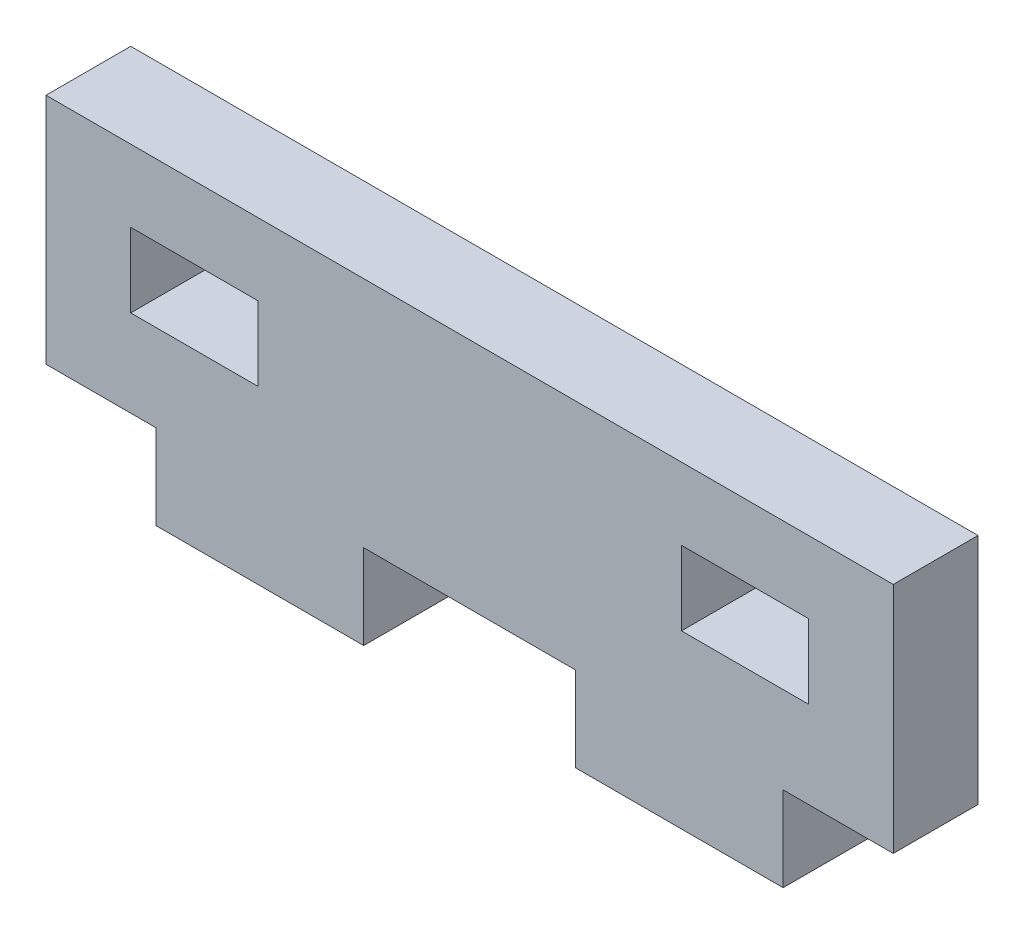
ISO-10303-21;
HEADER;
FILE_DESCRIPTION(('STEP AP214'),'2;1');
FILE_NAME('part.step','',(''),(''),'','','');
FILE_SCHEMA(('AUTOMOTIVE_DESIGN { 1 0 10303 214 1 1 1 1 }'));
ENDSEC;
DATA;
#1=APPLICATION_CONTEXT('core data for automotive mechanical design processes');
#2=APPLICATION_PROTOCOL_DEFINITION('international standard','automotive_design',2000,#1);
#3=PRODUCT_CONTEXT('',#1,'mechanical');
#4=PRODUCT('Part','Part','',(#3));
#5=PRODUCT_RELATED_PRODUCT_CATEGORY('part','',(#4));
#6=PRODUCT_DEFINITION_FORMATION('','',#4);
#7=PRODUCT_DEFINITION_CONTEXT('part definition',#1,'design');
#8=PRODUCT_DEFINITION('design','',#6,#7);
#9=PRODUCT_DEFINITION_SHAPE('','',#8);
#10=(LENGTH_UNIT() NAMED_UNIT(*) SI_UNIT(.MILLI.,.METRE.));
#11=(NAMED_UNIT(*) PLANE_ANGLE_UNIT() SI_UNIT($,.RADIAN.));
#12=(NAMED_UNIT(*) SI_UNIT($,.STERADIAN.) SOLID_ANGLE_UNIT());
#13=UNCERTAINTY_MEASURE_WITH_UNIT(LENGTH_MEASURE(1.E-05),#10,'distance_accuracy_value','');
#14=(GEOMETRIC_REPRESENTATION_CONTEXT(3) GLOBAL_UNCERTAINTY_ASSIGNED_CONTEXT((#13)) GLOBAL_UNIT_ASSIGNED_CONTEXT((#10,
#11,#12)) REPRESENTATION_CONTEXT('',''));
#15=CARTESIAN_POINT('',(0.,0.,0.));
#16=DIRECTION('',(0.,0.,1.));
#17=DIRECTION('',(1.,0.,0.));
#18=AXIS2_PLACEMENT_3D('',#15,#16,#17);
#19=CARTESIAN_POINT('',(35.,0.,4.));
#20=DIRECTION('',(0.,1.,0.));
#21=DIRECTION('',(0.,0.,1.));
#22=AXIS2_PLACEMENT_3D('',#19,#20,#21);
#23=PLANE('',#22);
#24=DIRECTION('',(1.,0.,0.));
#25=VECTOR('',#24,1.);
#26=CARTESIAN_POINT('',(35.,0.,4.));
#27=LINE('',#26,#25);
#28=CARTESIAN_POINT('',(2.7,0.,4.));
#29=VERTEX_POINT('',#28);
#30=CARTESIAN_POINT('',(12.5,0.,4.));
#31=VERTEX_POINT('',#30);
#32=EDGE_CURVE('E293',#29,#31,#27,.T.);
#33=ORIENTED_EDGE('',*,*,#32,.F.);
#34=DIRECTION('',(0.,0.,1.));
#35=VECTOR('',#34,1.);
#36=CARTESIAN_POINT('',(2.7,0.,-0.00100000000000013));
#37=LINE('',#36,#35);
#38=CARTESIAN_POINT('',(2.7,0.,0.));
#39=VERTEX_POINT('',#38);
#40=EDGE_CURVE('E249',#39,#29,#37,.T.);
#41=ORIENTED_EDGE('',*,*,#40,.F.);
#42=DIRECTION('',(1.,0.,0.));
#43=VECTOR('',#42,1.);
#44=CARTESIAN_POINT('',(35.,0.,0.));
#45=LINE('',#44,#43);
#46=CARTESIAN_POINT('',(12.5,0.,0.));
#47=VERTEX_POINT('',#46);
#48=EDGE_CURVE('E308',#39,#47,#45,.T.);
#49=ORIENTED_EDGE('',*,*,#48,.T.);
#50=DIRECTION('',(0.,0.,1.));
#51=VECTOR('',#50,1.);
#52=CARTESIAN_POINT('',(12.5,0.,-0.00100000000000013));
#53=LINE('',#52,#51);
#54=EDGE_CURVE('E273',#47,#31,#53,.T.);
#55=ORIENTED_EDGE('',*,*,#54,.T.);
#56=EDGE_LOOP('',(#33,#41,#49,#55));
#57=FACE_BOUND('',#56,.T.);
#58=ADVANCED_FACE('F35',(#57),#23,.F.);
#59=CARTESIAN_POINT('',(22.5,0.,4.));
#60=VERTEX_POINT('',#59);
#61=CARTESIAN_POINT('',(32.3,0.,4.));
#62=VERTEX_POINT('',#61);
#63=EDGE_CURVE('E290',#60,#62,#27,.T.);
#64=ORIENTED_EDGE('',*,*,#63,.F.);
#65=DIRECTION('',(0.,0.,1.));
#66=VECTOR('',#65,1.);
#67=CARTESIAN_POINT('',(22.5,0.,-0.00100000000000013));
#68=LINE('',#67,#66);
#69=CARTESIAN_POINT('',(22.5,0.,0.));
#70=VERTEX_POINT('',#69);
#71=EDGE_CURVE('E277',#70,#60,#68,.T.);
#72=ORIENTED_EDGE('',*,*,#71,.F.);
#73=CARTESIAN_POINT('',(32.3,0.,0.));
#74=VERTEX_POINT('',#73);
#75=EDGE_CURVE('E253',#70,#74,#45,.T.);
#76=ORIENTED_EDGE('',*,*,#75,.T.);
#77=DIRECTION('',(0.,0.,1.));
#78=VECTOR('',#77,1.);
#79=CARTESIAN_POINT('',(32.3,0.,-0.00100000000000013));
#80=LINE('',#79,#78);
#81=EDGE_CURVE('E285',#74,#62,#80,.T.);
#82=ORIENTED_EDGE('',*,*,#81,.T.);
#83=EDGE_LOOP('',(#64,#72,#76,#82));
#84=FACE_BOUND('',#83,.T.);
#85=ADVANCED_FACE('F37',(#84),#23,.F.);
#86=CARTESIAN_POINT('',(37.5,4.,4.));
#87=DIRECTION('',(0.,1.,0.));
#88=DIRECTION('',(0.,0.,1.));
#89=AXIS2_PLACEMENT_3D('',#86,#87,#88);
#90=PLANE('',#89);
#91=DIRECTION('',(1.,0.,0.));
#92=VECTOR('',#91,1.);
#93=CARTESIAN_POINT('',(37.5,4.,0.));
#94=LINE('',#93,#92);
#95=CARTESIAN_POINT('',(32.3,4.00000000000001,0.));
#96=VERTEX_POINT('',#95);
#97=CARTESIAN_POINT('',(37.5,4.,0.));
#98=VERTEX_POINT('',#97);
#99=EDGE_CURVE('E309',#96,#98,#94,.T.);
#100=ORIENTED_EDGE('',*,*,#99,.T.);
#101=DIRECTION('',(0.,0.,-1.));
#102=VECTOR('',#101,1.);
#103=CARTESIAN_POINT('',(37.5,4.,4.));
#104=LINE('',#103,#102);
#105=CARTESIAN_POINT('',(37.5,4.,4.));
#106=VERTEX_POINT('',#105);
#107=EDGE_CURVE('E11',#106,#98,#104,.T.);
#108=ORIENTED_EDGE('',*,*,#107,.F.);
#109=DIRECTION('',(1.,0.,0.));
#110=VECTOR('',#109,1.);
#111=CARTESIAN_POINT('',(37.5,4.,4.));
#112=LINE('',#111,#110);
#113=CARTESIAN_POINT('',(32.3,4.00000000000001,4.));
#114=VERTEX_POINT('',#113);
#115=EDGE_CURVE('E295',#114,#106,#112,.T.);
#116=ORIENTED_EDGE('',*,*,#115,.F.);
#117=DIRECTION('',(0.,0.,1.));
#118=VECTOR('',#117,1.);
#119=CARTESIAN_POINT('',(32.3,4.00000000000001,-0.00100000000000013));
#120=LINE('',#119,#118);
#121=EDGE_CURVE('E259',#96,#114,#120,.T.);
#122=ORIENTED_EDGE('',*,*,#121,.F.);
#123=EDGE_LOOP('',(#100,#108,#116,#122));
#124=FACE_BOUND('',#123,.T.);
#125=ADVANCED_FACE('F352',(#124),#90,.F.);
#126=CARTESIAN_POINT('',(37.5,15.,4.));
#127=DIRECTION('',(-1.,0.,0.));
#128=DIRECTION('',(0.,0.,1.));
#129=AXIS2_PLACEMENT_3D('',#126,#127,#128);
#130=PLANE('',#129);
#131=DIRECTION('',(0.,1.,0.));
#132=VECTOR('',#131,1.);
#133=CARTESIAN_POINT('',(37.5,15.,0.));
#134=LINE('',#133,#132);
#135=CARTESIAN_POINT('',(37.5,15.,0.));
#136=VERTEX_POINT('',#135);
#137=EDGE_CURVE('E311',#98,#136,#134,.T.);
#138=ORIENTED_EDGE('',*,*,#137,.T.);
#139=DIRECTION('',(0.,0.,-1.));
#140=VECTOR('',#139,1.);
#141=CARTESIAN_POINT('',(37.5,15.,4.));
#142=LINE('',#141,#140);
#143=CARTESIAN_POINT('',(37.5,15.,4.));
#144=VERTEX_POINT('',#143);
#145=EDGE_CURVE('E43',#144,#136,#142,.T.);
#146=ORIENTED_EDGE('',*,*,#145,.F.);
#147=DIRECTION('',(0.,1.,0.));
#148=VECTOR('',#147,1.);
#149=CARTESIAN_POINT('',(37.5,15.,4.));
#150=LINE('',#149,#148);
#151=EDGE_CURVE('E297',#106,#144,#150,.T.);
#152=ORIENTED_EDGE('',*,*,#151,.F.);
#153=ORIENTED_EDGE('',*,*,#107,.T.);
#154=EDGE_LOOP('',(#138,#146,#152,#153));
#155=FACE_BOUND('',#154,.T.);
#156=ADVANCED_FACE('F350',(#155),#130,.F.);
#157=CARTESIAN_POINT('',(-2.5,15.,4.));
#158=DIRECTION('',(0.,-1.,0.));
#159=DIRECTION('',(0.,0.,-1.));
#160=AXIS2_PLACEMENT_3D('',#157,#158,#159);
#161=PLANE('',#160);
#162=DIRECTION('',(-1.,0.,0.));
#163=VECTOR('',#162,1.);
#164=CARTESIAN_POINT('',(-2.5,15.,0.));
#165=LINE('',#164,#163);
#166=CARTESIAN_POINT('',(-2.5,15.,0.));
#167=VERTEX_POINT('',#166);
#168=EDGE_CURVE('E313',#136,#167,#165,.T.);
#169=ORIENTED_EDGE('',*,*,#168,.T.);
#170=DIRECTION('',(0.,0.,-1.));
#171=VECTOR('',#170,1.);
#172=CARTESIAN_POINT('',(-2.5,15.,4.));
#173=LINE('',#172,#171);
#174=CARTESIAN_POINT('',(-2.5,15.,4.));
#175=VERTEX_POINT('',#174);
#176=EDGE_CURVE('E320',#175,#167,#173,.T.);
#177=ORIENTED_EDGE('',*,*,#176,.F.);
#178=DIRECTION('',(-1.,0.,0.));
#179=VECTOR('',#178,1.);
#180=CARTESIAN_POINT('',(-2.5,15.,4.));
#181=LINE('',#180,#179);
#182=EDGE_CURVE('E299',#144,#175,#181,.T.);
#183=ORIENTED_EDGE('',*,*,#182,.F.);
#184=ORIENTED_EDGE('',*,*,#145,.T.);
#185=EDGE_LOOP('',(#169,#177,#183,#184));
#186=FACE_BOUND('',#185,.T.);
#187=ADVANCED_FACE('F327',(#186),#161,.F.);
#188=CARTESIAN_POINT('',(-2.5,4.,4.));
#189=DIRECTION('',(1.,0.,0.));
#190=DIRECTION('',(0.,1.,0.));
#191=AXIS2_PLACEMENT_3D('',#188,#189,#190);
#192=PLANE('',#191);
#193=DIRECTION('',(0.,-1.,0.));
#194=VECTOR('',#193,1.);
#195=CARTESIAN_POINT('',(-2.5,4.,0.));
#196=LINE('',#195,#194);
#197=CARTESIAN_POINT('',(-2.5,4.,0.));
#198=VERTEX_POINT('',#197);
#199=EDGE_CURVE('E315',#167,#198,#196,.T.);
#200=ORIENTED_EDGE('',*,*,#199,.T.);
#201=DIRECTION('',(0.,0.,-1.));
#202=VECTOR('',#201,1.);
#203=CARTESIAN_POINT('',(-2.5,4.,4.));
#204=LINE('',#203,#202);
#205=CARTESIAN_POINT('',(-2.5,4.,4.));
#206=VERTEX_POINT('',#205);
#207=EDGE_CURVE('E305',#206,#198,#204,.T.);
#208=ORIENTED_EDGE('',*,*,#207,.F.);
#209=DIRECTION('',(0.,-1.,0.));
#210=VECTOR('',#209,1.);
#211=CARTESIAN_POINT('',(-2.5,4.,4.));
#212=LINE('',#211,#210);
#213=EDGE_CURVE('E301',#175,#206,#212,.T.);
#214=ORIENTED_EDGE('',*,*,#213,.F.);
#215=ORIENTED_EDGE('',*,*,#176,.T.);
#216=EDGE_LOOP('',(#200,#208,#214,#215));
#217=FACE_BOUND('',#216,.T.);
#218=ADVANCED_FACE('F337',(#217),#192,.F.);
#219=CARTESIAN_POINT('',(0.,4.,4.));
#220=DIRECTION('',(0.,1.,0.));
#221=DIRECTION('',(-1.,0.,0.));
#222=AXIS2_PLACEMENT_3D('',#219,#220,#221);
#223=PLANE('',#222);
#224=DIRECTION('',(1.,0.,0.));
#225=VECTOR('',#224,1.);
#226=CARTESIAN_POINT('',(0.,4.,0.));
#227=LINE('',#226,#225);
#228=CARTESIAN_POINT('',(2.7,4.,0.));
#229=VERTEX_POINT('',#228);
#230=EDGE_CURVE('E294',#198,#229,#227,.T.);
#231=ORIENTED_EDGE('',*,*,#230,.T.);
#232=DIRECTION('',(0.,0.,1.));
#233=VECTOR('',#232,1.);
#234=CARTESIAN_POINT('',(2.7,4.,-0.00100000000000013));
#235=LINE('',#234,#233);
#236=CARTESIAN_POINT('',(2.7,4.,4.));
#237=VERTEX_POINT('',#236);
#238=EDGE_CURVE('E250',#229,#237,#235,.T.);
#239=ORIENTED_EDGE('',*,*,#238,.T.);
#240=DIRECTION('',(1.,0.,0.));
#241=VECTOR('',#240,1.);
#242=CARTESIAN_POINT('',(0.,4.,4.));
#243=LINE('',#242,#241);
#244=EDGE_CURVE('E303',#206,#237,#243,.T.);
#245=ORIENTED_EDGE('',*,*,#244,.F.);
#246=ORIENTED_EDGE('',*,*,#207,.T.);
#247=EDGE_LOOP('',(#231,#239,#245,#246));
#248=FACE_BOUND('',#247,.T.);
#249=ADVANCED_FACE('F341',(#248),#223,.F.);
#250=CARTESIAN_POINT('',(0.,0.,4.));
#251=DIRECTION('',(0.,0.,-1.));
#252=DIRECTION('',(-1.,0.,0.));
#253=AXIS2_PLACEMENT_3D('',#250,#251,#252);
#254=PLANE('',#253);
#255=DIRECTION('',(1.,0.,0.));
#256=VECTOR('',#255,1.);
#257=CARTESIAN_POINT('',(1.5,8.1,4.));
#258=LINE('',#257,#256);
#259=CARTESIAN_POINT('',(1.5,8.1,4.));
#260=VERTEX_POINT('',#259);
#261=CARTESIAN_POINT('',(7.5,8.1,4.));
#262=VERTEX_POINT('',#261);
#263=EDGE_CURVE('E196',#260,#262,#258,.T.);
#264=ORIENTED_EDGE('',*,*,#263,.F.);
#265=DIRECTION('',(0.,-1.,0.));
#266=VECTOR('',#265,1.);
#267=CARTESIAN_POINT('',(1.5,11.6,4.));
#268=LINE('',#267,#266);
#269=CARTESIAN_POINT('',(1.5,11.6,4.));
#270=VERTEX_POINT('',#269);
#271=EDGE_CURVE('E50',#270,#260,#268,.T.);
#272=ORIENTED_EDGE('',*,*,#271,.F.);
#273=DIRECTION('',(-1.,0.,0.));
#274=VECTOR('',#273,1.);
#275=CARTESIAN_POINT('',(1.5,11.6,4.));
#276=LINE('',#275,#274);
#277=CARTESIAN_POINT('',(7.5,11.6,4.));
#278=VERTEX_POINT('',#277);
#279=EDGE_CURVE('E189',#278,#270,#276,.T.);
#280=ORIENTED_EDGE('',*,*,#279,.F.);
#281=DIRECTION('',(0.,1.,0.));
#282=VECTOR('',#281,1.);
#283=CARTESIAN_POINT('',(7.5,11.6,4.));
#284=LINE('',#283,#282);
#285=EDGE_CURVE('E203',#262,#278,#284,.T.);
#286=ORIENTED_EDGE('',*,*,#285,.F.);
#287=EDGE_LOOP('',(#264,#272,#280,#286));
#288=FACE_BOUND('',#287,.T.);
#289=DIRECTION('',(1.,0.,0.));
#290=VECTOR('',#289,1.);
#291=CARTESIAN_POINT('',(27.5,8.1,4.));
#292=LINE('',#291,#290);
#293=CARTESIAN_POINT('',(27.5,8.1,4.));
#294=VERTEX_POINT('',#293);
#295=CARTESIAN_POINT('',(33.5,8.10000000000001,4.));
#296=VERTEX_POINT('',#295);
#297=EDGE_CURVE('E222',#294,#296,#292,.T.);
#298=ORIENTED_EDGE('',*,*,#297,.F.);
#299=DIRECTION('',(0.,-1.,0.));
#300=VECTOR('',#299,1.);
#301=CARTESIAN_POINT('',(27.5,8.1,4.));
#302=LINE('',#301,#300);
#303=CARTESIAN_POINT('',(27.5,11.6,4.));
#304=VERTEX_POINT('',#303);
#305=EDGE_CURVE('E58',#304,#294,#302,.T.);
#306=ORIENTED_EDGE('',*,*,#305,.F.);
#307=DIRECTION('',(-1.,0.,0.));
#308=VECTOR('',#307,1.);
#309=CARTESIAN_POINT('',(27.5,11.6,4.));
#310=LINE('',#309,#308);
#311=CARTESIAN_POINT('',(33.5,11.6,4.));
#312=VERTEX_POINT('',#311);
#313=EDGE_CURVE('E228',#312,#304,#310,.T.);
#314=ORIENTED_EDGE('',*,*,#313,.F.);
#315=DIRECTION('',(0.,1.,0.));
#316=VECTOR('',#315,1.);
#317=CARTESIAN_POINT('',(33.5,8.10000000000001,4.));
#318=LINE('',#317,#316);
#319=EDGE_CURVE('E225',#296,#312,#318,.T.);
#320=ORIENTED_EDGE('',*,*,#319,.F.);
#321=EDGE_LOOP('',(#298,#306,#314,#320));
#322=FACE_BOUND('',#321,.T.);
#323=ORIENTED_EDGE('',*,*,#244,.T.);
#324=DIRECTION('',(0.,1.,0.));
#325=VECTOR('',#324,1.);
#326=CARTESIAN_POINT('',(2.7,4.,4.));
#327=LINE('',#326,#325);
#328=EDGE_CURVE('E245',#29,#237,#327,.T.);
#329=ORIENTED_EDGE('',*,*,#328,.F.);
#330=ORIENTED_EDGE('',*,*,#32,.T.);
#331=DIRECTION('',(0.,-1.,0.));
#332=VECTOR('',#331,1.);
#333=CARTESIAN_POINT('',(12.5,4.,4.));
#334=LINE('',#333,#332);
#335=CARTESIAN_POINT('',(12.5,4.,4.));
#336=VERTEX_POINT('',#335);
#337=EDGE_CURVE('E265',#336,#31,#334,.T.);
#338=ORIENTED_EDGE('',*,*,#337,.F.);
#339=DIRECTION('',(-1.,0.,0.));
#340=VECTOR('',#339,1.);
#341=CARTESIAN_POINT('',(12.5,4.,4.));
#342=LINE('',#341,#340);
#343=CARTESIAN_POINT('',(22.5,4.,4.));
#344=VERTEX_POINT('',#343);
#345=EDGE_CURVE('E270',#344,#336,#342,.T.);
#346=ORIENTED_EDGE('',*,*,#345,.F.);
#347=DIRECTION('',(0.,1.,0.));
#348=VECTOR('',#347,1.);
#349=CARTESIAN_POINT('',(22.5,4.,4.));
#350=LINE('',#349,#348);
#351=EDGE_CURVE('E267',#60,#344,#350,.T.);
#352=ORIENTED_EDGE('',*,*,#351,.F.);
#353=ORIENTED_EDGE('',*,*,#63,.T.);
#354=DIRECTION('',(0.,-1.,0.));
#355=VECTOR('',#354,1.);
#356=CARTESIAN_POINT('',(32.3,0.,4.));
#357=LINE('',#356,#355);
#358=EDGE_CURVE('E283',#114,#62,#357,.T.);
#359=ORIENTED_EDGE('',*,*,#358,.F.);
#360=ORIENTED_EDGE('',*,*,#115,.T.);
#361=ORIENTED_EDGE('',*,*,#151,.T.);
#362=ORIENTED_EDGE('',*,*,#182,.T.);
#363=ORIENTED_EDGE('',*,*,#213,.T.);
#364=EDGE_LOOP('',(#323,#329,#330,#338,#346,#352,#353,#359,#360,#361,#362,#363));
#365=FACE_BOUND('',#364,.T.);
#366=ADVANCED_FACE('F345',(#288,#322,#365),#254,.F.);
#367=CARTESIAN_POINT('',(0.,0.,0.));
#368=DIRECTION('',(0.,0.,-1.));
#369=DIRECTION('',(-1.,0.,0.));
#370=AXIS2_PLACEMENT_3D('',#367,#368,#369);
#371=PLANE('',#370);
#372=DIRECTION('',(0.,-1.,0.));
#373=VECTOR('',#372,1.);
#374=CARTESIAN_POINT('',(1.5,11.6,0.));
#375=LINE('',#374,#373);
#376=CARTESIAN_POINT('',(1.5,11.6,0.));
#377=VERTEX_POINT('',#376);
#378=CARTESIAN_POINT('',(1.5,8.1,0.));
#379=VERTEX_POINT('',#378);
#380=EDGE_CURVE('E187',#377,#379,#375,.T.);
#381=ORIENTED_EDGE('',*,*,#380,.T.);
#382=DIRECTION('',(1.,0.,0.));
#383=VECTOR('',#382,1.);
#384=CARTESIAN_POINT('',(1.5,8.1,0.));
#385=LINE('',#384,#383);
#386=CARTESIAN_POINT('',(7.5,8.1,0.));
#387=VERTEX_POINT('',#386);
#388=EDGE_CURVE('E173',#379,#387,#385,.T.);
#389=ORIENTED_EDGE('',*,*,#388,.T.);
#390=DIRECTION('',(0.,1.,0.));
#391=VECTOR('',#390,1.);
#392=CARTESIAN_POINT('',(7.5,11.6,0.));
#393=LINE('',#392,#391);
#394=CARTESIAN_POINT('',(7.5,11.6,0.));
#395=VERTEX_POINT('',#394);
#396=EDGE_CURVE('E198',#387,#395,#393,.T.);
#397=ORIENTED_EDGE('',*,*,#396,.T.);
#398=DIRECTION('',(-1.,0.,0.));
#399=VECTOR('',#398,1.);
#400=CARTESIAN_POINT('',(1.5,11.6,0.));
#401=LINE('',#400,#399);
#402=EDGE_CURVE('E194',#395,#377,#401,.T.);
#403=ORIENTED_EDGE('',*,*,#402,.T.);
#404=EDGE_LOOP('',(#381,#389,#397,#403));
#405=FACE_BOUND('',#404,.T.);
#406=DIRECTION('',(0.,-1.,0.));
#407=VECTOR('',#406,1.);
#408=CARTESIAN_POINT('',(27.5,8.1,0.));
#409=LINE('',#408,#407);
#410=CARTESIAN_POINT('',(27.5,11.6,0.));
#411=VERTEX_POINT('',#410);
#412=CARTESIAN_POINT('',(27.5,8.1,0.));
#413=VERTEX_POINT('',#412);
#414=EDGE_CURVE('E218',#411,#413,#409,.T.);
#415=ORIENTED_EDGE('',*,*,#414,.T.);
#416=DIRECTION('',(1.,0.,0.));
#417=VECTOR('',#416,1.);
#418=CARTESIAN_POINT('',(27.5,8.1,0.));
#419=LINE('',#418,#417);
#420=CARTESIAN_POINT('',(33.5,8.10000000000001,0.));
#421=VERTEX_POINT('',#420);
#422=EDGE_CURVE('E234',#413,#421,#419,.T.);
#423=ORIENTED_EDGE('',*,*,#422,.T.);
#424=DIRECTION('',(0.,1.,0.));
#425=VECTOR('',#424,1.);
#426=CARTESIAN_POINT('',(33.5,8.10000000000001,0.));
#427=LINE('',#426,#425);
#428=CARTESIAN_POINT('',(33.5,11.6,0.));
#429=VERTEX_POINT('',#428);
#430=EDGE_CURVE('E212',#421,#429,#427,.T.);
#431=ORIENTED_EDGE('',*,*,#430,.T.);
#432=DIRECTION('',(-1.,0.,0.));
#433=VECTOR('',#432,1.);
#434=CARTESIAN_POINT('',(27.5,11.6,0.));
#435=LINE('',#434,#433);
#436=EDGE_CURVE('E215',#429,#411,#435,.T.);
#437=ORIENTED_EDGE('',*,*,#436,.T.);
#438=EDGE_LOOP('',(#415,#423,#431,#437));
#439=FACE_BOUND('',#438,.T.);
#440=DIRECTION('',(0.,1.,0.));
#441=VECTOR('',#440,1.);
#442=CARTESIAN_POINT('',(2.7,4.,0.));
#443=LINE('',#442,#441);
#444=EDGE_CURVE('E242',#39,#229,#443,.T.);
#445=ORIENTED_EDGE('',*,*,#444,.T.);
#446=ORIENTED_EDGE('',*,*,#230,.F.);
#447=ORIENTED_EDGE('',*,*,#199,.F.);
#448=ORIENTED_EDGE('',*,*,#168,.F.);
#449=ORIENTED_EDGE('',*,*,#137,.F.);
#450=ORIENTED_EDGE('',*,*,#99,.F.);
#451=DIRECTION('',(0.,-1.,0.));
#452=VECTOR('',#451,1.);
#453=CARTESIAN_POINT('',(32.3,0.,0.));
#454=LINE('',#453,#452);
#455=EDGE_CURVE('E183',#96,#74,#454,.T.);
#456=ORIENTED_EDGE('',*,*,#455,.T.);
#457=ORIENTED_EDGE('',*,*,#75,.F.);
#458=DIRECTION('',(0.,1.,0.));
#459=VECTOR('',#458,1.);
#460=CARTESIAN_POINT('',(22.5,4.,0.));
#461=LINE('',#460,#459);
#462=CARTESIAN_POINT('',(22.5,4.,0.));
#463=VERTEX_POINT('',#462);
#464=EDGE_CURVE('E255',#70,#463,#461,.T.);
#465=ORIENTED_EDGE('',*,*,#464,.T.);
#466=DIRECTION('',(-1.,0.,0.));
#467=VECTOR('',#466,1.);
#468=CARTESIAN_POINT('',(12.5,4.,0.));
#469=LINE('',#468,#467);
#470=CARTESIAN_POINT('',(12.5,4.,0.));
#471=VERTEX_POINT('',#470);
#472=EDGE_CURVE('E258',#463,#471,#469,.T.);
#473=ORIENTED_EDGE('',*,*,#472,.T.);
#474=DIRECTION('',(0.,-1.,0.));
#475=VECTOR('',#474,1.);
#476=CARTESIAN_POINT('',(12.5,4.,0.));
#477=LINE('',#476,#475);
#478=EDGE_CURVE('E262',#471,#47,#477,.T.);
#479=ORIENTED_EDGE('',*,*,#478,.T.);
#480=ORIENTED_EDGE('',*,*,#48,.F.);
#481=EDGE_LOOP('',(#445,#446,#447,#448,#449,#450,#456,#457,#465,#473,#479,#480));
#482=FACE_BOUND('',#481,.T.);
#483=ADVANCED_FACE('F192',(#405,#439,#482),#371,.T.);
#484=CARTESIAN_POINT('',(32.3,0.,-0.00100000000000013));
#485=DIRECTION('',(-1.,0.,0.));
#486=DIRECTION('',(0.,0.,1.));
#487=AXIS2_PLACEMENT_3D('',#484,#485,#486);
#488=PLANE('',#487);
#489=ORIENTED_EDGE('',*,*,#121,.T.);
#490=ORIENTED_EDGE('',*,*,#358,.T.);
#491=ORIENTED_EDGE('',*,*,#81,.F.);
#492=ORIENTED_EDGE('',*,*,#455,.F.);
#493=EDGE_LOOP('',(#489,#490,#491,#492));
#494=FACE_BOUND('',#493,.T.);
#495=ADVANCED_FACE('F407',(#494),#488,.F.);
#496=CARTESIAN_POINT('',(12.5,4.,-0.00100000000000013));
#497=DIRECTION('',(-1.,0.,0.));
#498=DIRECTION('',(0.,-1.,0.));
#499=AXIS2_PLACEMENT_3D('',#496,#497,#498);
#500=PLANE('',#499);
#501=DIRECTION('',(0.,0.,1.));
#502=VECTOR('',#501,1.);
#503=CARTESIAN_POINT('',(12.5,4.,-0.00100000000000013));
#504=LINE('',#503,#502);
#505=EDGE_CURVE('E246',#471,#336,#504,.T.);
#506=ORIENTED_EDGE('',*,*,#505,.T.);
#507=ORIENTED_EDGE('',*,*,#337,.T.);
#508=ORIENTED_EDGE('',*,*,#54,.F.);
#509=ORIENTED_EDGE('',*,*,#478,.F.);
#510=EDGE_LOOP('',(#506,#507,#508,#509));
#511=FACE_BOUND('',#510,.T.);
#512=ADVANCED_FACE('F413',(#511),#500,.F.);
#513=CARTESIAN_POINT('',(12.5,4.,-0.00100000000000013));
#514=DIRECTION('',(0.,1.,0.));
#515=DIRECTION('',(-1.,0.,0.));
#516=AXIS2_PLACEMENT_3D('',#513,#514,#515);
#517=PLANE('',#516);
#518=DIRECTION('',(0.,0.,1.));
#519=VECTOR('',#518,1.);
#520=CARTESIAN_POINT('',(22.5,4.,-0.00100000000000013));
#521=LINE('',#520,#519);
#522=EDGE_CURVE('E275',#463,#344,#521,.T.);
#523=ORIENTED_EDGE('',*,*,#522,.T.);
#524=ORIENTED_EDGE('',*,*,#345,.T.);
#525=ORIENTED_EDGE('',*,*,#505,.F.);
#526=ORIENTED_EDGE('',*,*,#472,.F.);
#527=EDGE_LOOP('',(#523,#524,#525,#526));
#528=FACE_BOUND('',#527,.T.);
#529=ADVANCED_FACE('F367',(#528),#517,.F.);
#530=CARTESIAN_POINT('',(22.5,4.,-0.00100000000000013));
#531=DIRECTION('',(1.,0.,0.));
#532=DIRECTION('',(0.,0.,-1.));
#533=AXIS2_PLACEMENT_3D('',#530,#531,#532);
#534=PLANE('',#533);
#535=ORIENTED_EDGE('',*,*,#71,.T.);
#536=ORIENTED_EDGE('',*,*,#351,.T.);
#537=ORIENTED_EDGE('',*,*,#522,.F.);
#538=ORIENTED_EDGE('',*,*,#464,.F.);
#539=EDGE_LOOP('',(#535,#536,#537,#538));
#540=FACE_BOUND('',#539,.T.);
#541=ADVANCED_FACE('F362',(#540),#534,.F.);
#542=CARTESIAN_POINT('',(2.7,4.,-0.00100000000000013));
#543=DIRECTION('',(1.,0.,0.));
#544=DIRECTION('',(0.,1.,0.));
#545=AXIS2_PLACEMENT_3D('',#542,#543,#544);
#546=PLANE('',#545);
#547=ORIENTED_EDGE('',*,*,#40,.T.);
#548=ORIENTED_EDGE('',*,*,#328,.T.);
#549=ORIENTED_EDGE('',*,*,#238,.F.);
#550=ORIENTED_EDGE('',*,*,#444,.F.);
#551=EDGE_LOOP('',(#547,#548,#549,#550));
#552=FACE_BOUND('',#551,.T.);
#553=ADVANCED_FACE('F375',(#552),#546,.F.);
#554=CARTESIAN_POINT('',(27.5,8.1,-0.00100000000000013));
#555=DIRECTION('',(-1.,0.,0.));
#556=DIRECTION('',(0.,0.,1.));
#557=AXIS2_PLACEMENT_3D('',#554,#555,#556);
#558=PLANE('',#557);
#559=DIRECTION('',(0.,0.,1.));
#560=VECTOR('',#559,1.);
#561=CARTESIAN_POINT('',(27.5,11.6,-0.00100000000000013));
#562=LINE('',#561,#560);
#563=EDGE_CURVE('E232',#411,#304,#562,.T.);
#564=ORIENTED_EDGE('',*,*,#563,.T.);
#565=ORIENTED_EDGE('',*,*,#305,.T.);
#566=DIRECTION('',(0.,0.,1.));
#567=VECTOR('',#566,1.);
#568=CARTESIAN_POINT('',(27.5,8.1,-0.00100000000000013));
#569=LINE('',#568,#567);
#570=EDGE_CURVE('E231',#413,#294,#569,.T.);
#571=ORIENTED_EDGE('',*,*,#570,.F.);
#572=ORIENTED_EDGE('',*,*,#414,.F.);
#573=EDGE_LOOP('',(#564,#565,#571,#572));
#574=FACE_BOUND('',#573,.T.);
#575=ADVANCED_FACE('F377',(#574),#558,.F.);
#576=CARTESIAN_POINT('',(27.5,11.6,-0.00100000000000013));
#577=DIRECTION('',(0.,1.,0.));
#578=DIRECTION('',(-1.,0.,0.));
#579=AXIS2_PLACEMENT_3D('',#576,#577,#578);
#580=PLANE('',#579);
#581=DIRECTION('',(0.,0.,1.));
#582=VECTOR('',#581,1.);
#583=CARTESIAN_POINT('',(33.5,11.6,-0.00100000000000013));
#584=LINE('',#583,#582);
#585=EDGE_CURVE('E235',#429,#312,#584,.T.);
#586=ORIENTED_EDGE('',*,*,#585,.T.);
#587=ORIENTED_EDGE('',*,*,#313,.T.);
#588=ORIENTED_EDGE('',*,*,#563,.F.);
#589=ORIENTED_EDGE('',*,*,#436,.F.);
#590=EDGE_LOOP('',(#586,#587,#588,#589));
#591=FACE_BOUND('',#590,.T.);
#592=ADVANCED_FACE('F383',(#591),#580,.F.);
#593=CARTESIAN_POINT('',(33.5,8.10000000000001,-0.00100000000000013));
#594=DIRECTION('',(1.,0.,0.));
#595=DIRECTION('',(0.,0.,-1.));
#596=AXIS2_PLACEMENT_3D('',#593,#594,#595);
#597=PLANE('',#596);
#598=DIRECTION('',(0.,0.,1.));
#599=VECTOR('',#598,1.);
#600=CARTESIAN_POINT('',(33.5,8.10000000000001,-0.00100000000000013));
#601=LINE('',#600,#599);
#602=EDGE_CURVE('E237',#421,#296,#601,.T.);
#603=ORIENTED_EDGE('',*,*,#602,.T.);
#604=ORIENTED_EDGE('',*,*,#319,.T.);
#605=ORIENTED_EDGE('',*,*,#585,.F.);
#606=ORIENTED_EDGE('',*,*,#430,.F.);
#607=EDGE_LOOP('',(#603,#604,#605,#606));
#608=FACE_BOUND('',#607,.T.);
#609=ADVANCED_FACE('F457',(#608),#597,.F.);
#610=CARTESIAN_POINT('',(27.5,8.1,-0.00100000000000013));
#611=DIRECTION('',(0.,-1.,0.));
#612=DIRECTION('',(1.,0.,0.));
#613=AXIS2_PLACEMENT_3D('',#610,#611,#612);
#614=PLANE('',#613);
#615=ORIENTED_EDGE('',*,*,#570,.T.);
#616=ORIENTED_EDGE('',*,*,#297,.T.);
#617=ORIENTED_EDGE('',*,*,#602,.F.);
#618=ORIENTED_EDGE('',*,*,#422,.F.);
#619=EDGE_LOOP('',(#615,#616,#617,#618));
#620=FACE_BOUND('',#619,.T.);
#621=ADVANCED_FACE('F467',(#620),#614,.F.);
#622=CARTESIAN_POINT('',(1.5,11.6,-0.00100000000000013));
#623=DIRECTION('',(-1.,0.,0.));
#624=DIRECTION('',(0.,-1.,0.));
#625=AXIS2_PLACEMENT_3D('',#622,#623,#624);
#626=PLANE('',#625);
#627=DIRECTION('',(0.,0.,1.));
#628=VECTOR('',#627,1.);
#629=CARTESIAN_POINT('',(1.5,11.6,-0.00100000000000013));
#630=LINE('',#629,#628);
#631=EDGE_CURVE('E184',#377,#270,#630,.T.);
#632=ORIENTED_EDGE('',*,*,#631,.T.);
#633=ORIENTED_EDGE('',*,*,#271,.T.);
#634=DIRECTION('',(0.,0.,1.));
#635=VECTOR('',#634,1.);
#636=CARTESIAN_POINT('',(1.5,8.1,-0.00100000000000013));
#637=LINE('',#636,#635);
#638=EDGE_CURVE('E176',#379,#260,#637,.T.);
#639=ORIENTED_EDGE('',*,*,#638,.F.);
#640=ORIENTED_EDGE('',*,*,#380,.F.);
#641=EDGE_LOOP('',(#632,#633,#639,#640));
#642=FACE_BOUND('',#641,.T.);
#643=ADVANCED_FACE('F186',(#642),#626,.F.);
#644=CARTESIAN_POINT('',(1.5,11.6,-0.00100000000000013));
#645=DIRECTION('',(0.,1.,0.));
#646=DIRECTION('',(-1.,0.,0.));
#647=AXIS2_PLACEMENT_3D('',#644,#645,#646);
#648=PLANE('',#647);
#649=DIRECTION('',(0.,0.,1.));
#650=VECTOR('',#649,1.);
#651=CARTESIAN_POINT('',(7.5,11.6,-0.00100000000000013));
#652=LINE('',#651,#650);
#653=EDGE_CURVE('E209',#395,#278,#652,.T.);
#654=ORIENTED_EDGE('',*,*,#653,.T.);
#655=ORIENTED_EDGE('',*,*,#279,.T.);
#656=ORIENTED_EDGE('',*,*,#631,.F.);
#657=ORIENTED_EDGE('',*,*,#402,.F.);
#658=EDGE_LOOP('',(#654,#655,#656,#657));
#659=FACE_BOUND('',#658,.T.);
#660=ADVANCED_FACE('F486',(#659),#648,.F.);
#661=CARTESIAN_POINT('',(7.5,11.6,-0.00100000000000013));
#662=DIRECTION('',(1.,0.,0.));
#663=DIRECTION('',(0.,1.,0.));
#664=AXIS2_PLACEMENT_3D('',#661,#662,#663);
#665=PLANE('',#664);
#666=DIRECTION('',(0.,0.,1.));
#667=VECTOR('',#666,1.);
#668=CARTESIAN_POINT('',(7.5,8.1,-0.00100000000000013));
#669=LINE('',#668,#667);
#670=EDGE_CURVE('E178',#387,#262,#669,.T.);
#671=ORIENTED_EDGE('',*,*,#670,.T.);
#672=ORIENTED_EDGE('',*,*,#285,.T.);
#673=ORIENTED_EDGE('',*,*,#653,.F.);
#674=ORIENTED_EDGE('',*,*,#396,.F.);
#675=EDGE_LOOP('',(#671,#672,#673,#674));
#676=FACE_BOUND('',#675,.T.);
#677=ADVANCED_FACE('F495',(#676),#665,.F.);
#678=CARTESIAN_POINT('',(1.5,8.1,-0.00100000000000013));
#679=DIRECTION('',(0.,-1.,0.));
#680=DIRECTION('',(0.,0.,-1.));
#681=AXIS2_PLACEMENT_3D('',#678,#679,#680);
#682=PLANE('',#681);
#683=ORIENTED_EDGE('',*,*,#638,.T.);
#684=ORIENTED_EDGE('',*,*,#263,.T.);
#685=ORIENTED_EDGE('',*,*,#670,.F.);
#686=ORIENTED_EDGE('',*,*,#388,.F.);
#687=EDGE_LOOP('',(#683,#684,#685,#686));
#688=FACE_BOUND('',#687,.T.);
#689=ADVANCED_FACE('F174',(#688),#682,.F.);
#690=CLOSED_SHELL('',(#58,#85,#125,#156,#187,#218,#249,#366,#483,#495,#512,#529,#541,#553,#575,
#592,#609,#621,#643,#660,#677,#689));
#691=MANIFOLD_SOLID_BREP('B2',#690);
#692=ADVANCED_BREP_SHAPE_REPRESENTATION('',(#18,#691),#14);
#693=SHAPE_DEFINITION_REPRESENTATION(#9,#692);
ENDSEC;
END-ISO-10303-21;
